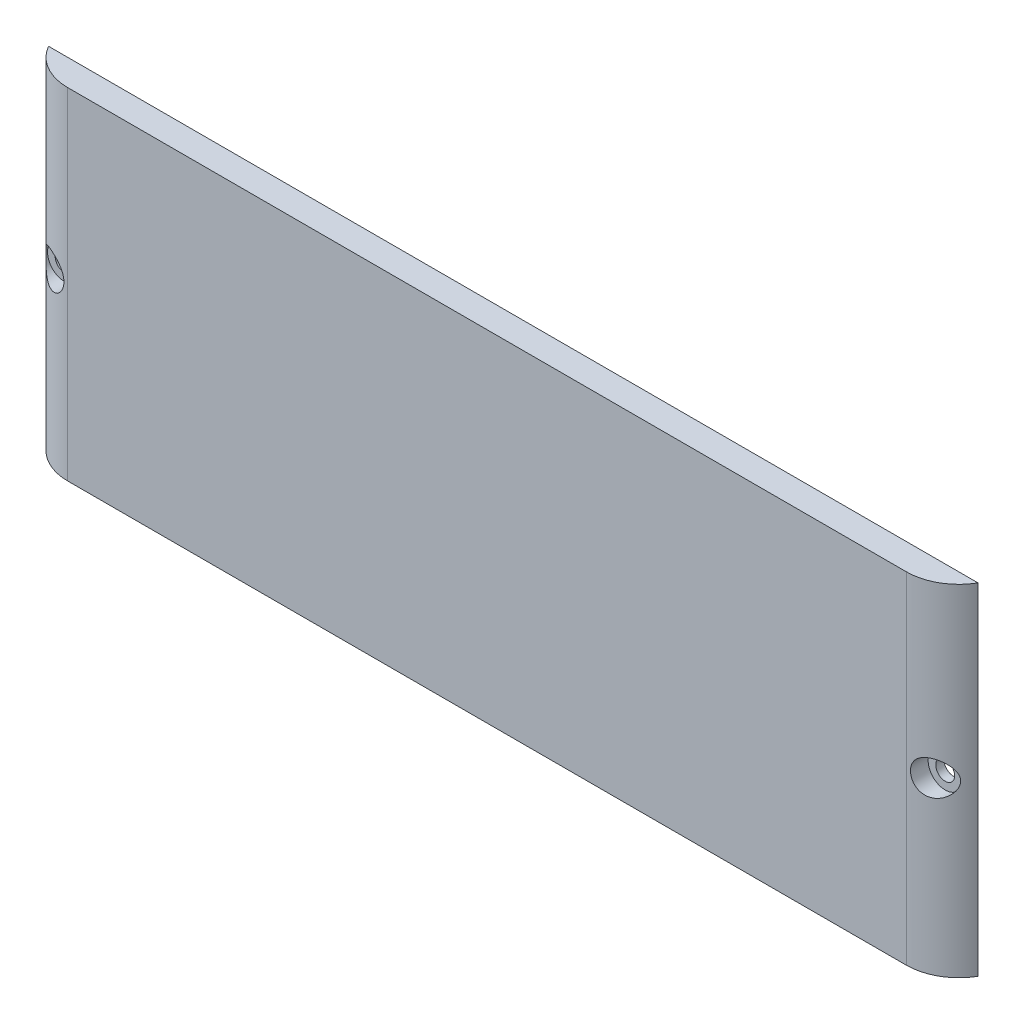
ISO-10303-21;
HEADER;
FILE_DESCRIPTION(('STEP AP214'),'2;1');
FILE_NAME('part.step','',(''),(''),'','','');
FILE_SCHEMA(('AUTOMOTIVE_DESIGN { 1 0 10303 214 1 1 1 1 }'));
ENDSEC;
DATA;
#1=APPLICATION_CONTEXT('core data for automotive mechanical design processes');
#2=APPLICATION_PROTOCOL_DEFINITION('international standard','automotive_design',2000,#1);
#3=PRODUCT_CONTEXT('',#1,'mechanical');
#4=PRODUCT('Part','Part','',(#3));
#5=PRODUCT_RELATED_PRODUCT_CATEGORY('part','',(#4));
#6=PRODUCT_DEFINITION_FORMATION('','',#4);
#7=PRODUCT_DEFINITION_CONTEXT('part definition',#1,'design');
#8=PRODUCT_DEFINITION('design','',#6,#7);
#9=PRODUCT_DEFINITION_SHAPE('','',#8);
#10=(LENGTH_UNIT() NAMED_UNIT(*) SI_UNIT(.MILLI.,.METRE.));
#11=(NAMED_UNIT(*) PLANE_ANGLE_UNIT() SI_UNIT($,.RADIAN.));
#12=(NAMED_UNIT(*) SI_UNIT($,.STERADIAN.) SOLID_ANGLE_UNIT());
#13=UNCERTAINTY_MEASURE_WITH_UNIT(LENGTH_MEASURE(1.E-05),#10,'distance_accuracy_value','');
#14=(GEOMETRIC_REPRESENTATION_CONTEXT(3) GLOBAL_UNCERTAINTY_ASSIGNED_CONTEXT((#13)) GLOBAL_UNIT_ASSIGNED_CONTEXT((#10,
#11,#12)) REPRESENTATION_CONTEXT('',''));
#15=CARTESIAN_POINT('',(0.,0.,0.));
#16=DIRECTION('',(0.,0.,1.));
#17=DIRECTION('',(1.,0.,0.));
#18=AXIS2_PLACEMENT_3D('',#15,#16,#17);
#19=CARTESIAN_POINT('',(0.,0.,5.));
#20=DIRECTION('',(0.,0.,-1.));
#21=DIRECTION('',(-1.,0.,0.));
#22=AXIS2_PLACEMENT_3D('',#19,#20,#21);
#23=PLANE('',#22);
#24=DIRECTION('',(0.,1.,0.));
#25=VECTOR('',#24,1.);
#26=CARTESIAN_POINT('',(79.9999999999999,-32.5,4.99999999999998));
#27=LINE('',#26,#25);
#28=CARTESIAN_POINT('',(79.9999999999999,-32.5,4.99999999999998));
#29=VERTEX_POINT('',#28);
#30=CARTESIAN_POINT('',(79.9999999999999,32.5,4.99999999999998));
#31=VERTEX_POINT('',#30);
#32=EDGE_CURVE('E84',#29,#31,#27,.T.);
#33=ORIENTED_EDGE('',*,*,#32,.T.);
#34=DIRECTION('',(-1.,0.,0.));
#35=VECTOR('',#34,1.);
#36=CARTESIAN_POINT('',(90.,32.5,5.));
#37=LINE('',#36,#35);
#38=CARTESIAN_POINT('',(-79.9999999999999,32.5,5.));
#39=VERTEX_POINT('',#38);
#40=EDGE_CURVE('E11',#31,#39,#37,.T.);
#41=ORIENTED_EDGE('',*,*,#40,.T.);
#42=DIRECTION('',(0.,1.,0.));
#43=VECTOR('',#42,1.);
#44=CARTESIAN_POINT('',(-79.9999999999999,-32.5,5.));
#45=LINE('',#44,#43);
#46=CARTESIAN_POINT('',(-79.9999999999999,-32.5,5.));
#47=VERTEX_POINT('',#46);
#48=EDGE_CURVE('E102',#47,#39,#45,.T.);
#49=ORIENTED_EDGE('',*,*,#48,.F.);
#50=DIRECTION('',(1.,0.,0.));
#51=VECTOR('',#50,1.);
#52=CARTESIAN_POINT('',(90.,-32.5,5.));
#53=LINE('',#52,#51);
#54=EDGE_CURVE('E52',#47,#29,#53,.T.);
#55=ORIENTED_EDGE('',*,*,#54,.T.);
#56=EDGE_LOOP('',(#33,#41,#49,#55));
#57=FACE_BOUND('',#56,.T.);
#58=ADVANCED_FACE('F38',(#57),#23,.F.);
#59=CARTESIAN_POINT('',(90.,-32.5,5.));
#60=DIRECTION('',(0.,1.,0.));
#61=DIRECTION('',(-1.,0.,0.));
#62=AXIS2_PLACEMENT_3D('',#59,#60,#61);
#63=PLANE('',#62);
#64=DIRECTION('',(1.,0.,0.));
#65=VECTOR('',#64,1.);
#66=CARTESIAN_POINT('',(90.,-32.5,0.));
#67=LINE('',#66,#65);
#68=CARTESIAN_POINT('',(-88.6602540378444,-32.5,0.));
#69=VERTEX_POINT('',#68);
#70=CARTESIAN_POINT('',(88.6602540378444,-32.5,0.));
#71=VERTEX_POINT('',#70);
#72=EDGE_CURVE('E99',#69,#71,#67,.T.);
#73=ORIENTED_EDGE('',*,*,#72,.T.);
#74=CARTESIAN_POINT('',(80.,-32.5,-5.00000000000002));
#75=DIRECTION('',(0.,-1.,0.));
#76=DIRECTION('',(-1.,0.,0.));
#77=AXIS2_PLACEMENT_3D('',#74,#75,#76);
#78=CIRCLE('',#77,10.);
#79=EDGE_CURVE('E60',#71,#29,#78,.T.);
#80=ORIENTED_EDGE('',*,*,#79,.T.);
#81=ORIENTED_EDGE('',*,*,#54,.F.);
#82=CARTESIAN_POINT('',(-80.,-32.5,-5.));
#83=DIRECTION('',(0.,-1.,0.));
#84=DIRECTION('',(1.,0.,0.));
#85=AXIS2_PLACEMENT_3D('',#82,#83,#84);
#86=CIRCLE('',#85,10.);
#87=EDGE_CURVE('E154',#47,#69,#86,.T.);
#88=ORIENTED_EDGE('',*,*,#87,.T.);
#89=EDGE_LOOP('',(#73,#80,#81,#88));
#90=FACE_BOUND('',#89,.T.);
#91=ADVANCED_FACE('F40',(#90),#63,.F.);
#92=CARTESIAN_POINT('',(90.,32.5,5.));
#93=DIRECTION('',(0.,-1.,0.));
#94=DIRECTION('',(1.,0.,0.));
#95=AXIS2_PLACEMENT_3D('',#92,#93,#94);
#96=PLANE('',#95);
#97=ORIENTED_EDGE('',*,*,#40,.F.);
#98=CARTESIAN_POINT('',(80.,32.5,-5.00000000000002));
#99=DIRECTION('',(0.,-1.,0.));
#100=DIRECTION('',(-1.,0.,0.));
#101=AXIS2_PLACEMENT_3D('',#98,#99,#100);
#102=CIRCLE('',#101,10.);
#103=CARTESIAN_POINT('',(88.6602540378444,32.5,0.));
#104=VERTEX_POINT('',#103);
#105=EDGE_CURVE('E88',#104,#31,#102,.T.);
#106=ORIENTED_EDGE('',*,*,#105,.F.);
#107=DIRECTION('',(-1.,0.,0.));
#108=VECTOR('',#107,1.);
#109=CARTESIAN_POINT('',(90.,32.5,0.));
#110=LINE('',#109,#108);
#111=CARTESIAN_POINT('',(-88.6602540378443,32.5,0.));
#112=VERTEX_POINT('',#111);
#113=EDGE_CURVE('E103',#104,#112,#110,.T.);
#114=ORIENTED_EDGE('',*,*,#113,.T.);
#115=CARTESIAN_POINT('',(-80.,32.5,-5.));
#116=DIRECTION('',(0.,-1.,0.));
#117=DIRECTION('',(1.,0.,0.));
#118=AXIS2_PLACEMENT_3D('',#115,#116,#117);
#119=CIRCLE('',#118,10.);
#120=EDGE_CURVE('E68',#39,#112,#119,.T.);
#121=ORIENTED_EDGE('',*,*,#120,.F.);
#122=EDGE_LOOP('',(#97,#106,#114,#121));
#123=FACE_BOUND('',#122,.T.);
#124=ADVANCED_FACE('F141',(#123),#96,.F.);
#125=CARTESIAN_POINT('',(0.,0.,0.));
#126=DIRECTION('',(0.,0.,-1.));
#127=DIRECTION('',(-1.,0.,0.));
#128=AXIS2_PLACEMENT_3D('',#125,#126,#127);
#129=PLANE('',#128);
#130=DIRECTION('',(0.,1.,0.));
#131=VECTOR('',#130,1.);
#132=CARTESIAN_POINT('',(88.6602540378444,-32.5,0.));
#133=LINE('',#132,#131);
#134=EDGE_CURVE('E161',#71,#104,#133,.T.);
#135=ORIENTED_EDGE('',*,*,#134,.F.);
#136=ORIENTED_EDGE('',*,*,#72,.F.);
#137=DIRECTION('',(0.,1.,0.));
#138=VECTOR('',#137,1.);
#139=CARTESIAN_POINT('',(-88.6602540378444,-32.5,0.));
#140=LINE('',#139,#138);
#141=EDGE_CURVE('E125',#112,#69,#140,.F.);
#142=ORIENTED_EDGE('',*,*,#141,.F.);
#143=ORIENTED_EDGE('',*,*,#113,.F.);
#144=EDGE_LOOP('',(#135,#136,#142,#143));
#145=FACE_BOUND('',#144,.T.);
#146=CARTESIAN_POINT('',(-84.,0.,0.));
#147=DIRECTION('',(0.,0.,-1.));
#148=DIRECTION('',(-1.,0.,0.));
#149=AXIS2_PLACEMENT_3D('',#146,#147,#148);
#150=CIRCLE('',#149,1.8);
#151=CARTESIAN_POINT('',(-85.8,0.,0.));
#152=VERTEX_POINT('',#151);
#153=EDGE_CURVE('E115',#152,#152,#150,.T.);
#154=ORIENTED_EDGE('',*,*,#153,.F.);
#155=EDGE_LOOP('',(#154));
#156=FACE_BOUND('',#155,.T.);
#157=CARTESIAN_POINT('',(84.,0.,0.));
#158=DIRECTION('',(0.,0.,-1.));
#159=DIRECTION('',(-1.,0.,0.));
#160=AXIS2_PLACEMENT_3D('',#157,#158,#159);
#161=CIRCLE('',#160,1.8);
#162=CARTESIAN_POINT('',(82.2,0.,0.));
#163=VERTEX_POINT('',#162);
#164=EDGE_CURVE('E111',#163,#163,#161,.T.);
#165=ORIENTED_EDGE('',*,*,#164,.F.);
#166=EDGE_LOOP('',(#165));
#167=FACE_BOUND('',#166,.T.);
#168=ADVANCED_FACE('F146',(#145,#156,#167),#129,.T.);
#169=CARTESIAN_POINT('',(84.,0.,5.));
#170=DIRECTION('',(0.,0.,1.));
#171=DIRECTION('',(1.,0.,0.));
#172=AXIS2_PLACEMENT_3D('',#169,#170,#171);
#173=CYLINDRICAL_SURFACE('',#172,1.8);
#174=ORIENTED_EDGE('',*,*,#164,.T.);
#175=EDGE_LOOP('',(#174));
#176=FACE_BOUND('',#175,.T.);
#177=CARTESIAN_POINT('',(84.,0.,1.6));
#178=DIRECTION('',(0.,0.,1.));
#179=DIRECTION('',(1.,0.,0.));
#180=AXIS2_PLACEMENT_3D('',#177,#178,#179);
#181=CIRCLE('',#180,1.8);
#182=CARTESIAN_POINT('',(85.8,0.,1.6));
#183=VERTEX_POINT('',#182);
#184=EDGE_CURVE('E108',#183,#183,#181,.T.);
#185=ORIENTED_EDGE('',*,*,#184,.T.);
#186=EDGE_LOOP('',(#185));
#187=FACE_BOUND('',#186,.T.);
#188=ADVANCED_FACE('F144',(#176,#187),#173,.F.);
#189=CARTESIAN_POINT('',(85.8,0.,1.6));
#190=DIRECTION('',(0.,0.,-1.));
#191=DIRECTION('',(-1.,0.,0.));
#192=AXIS2_PLACEMENT_3D('',#189,#190,#191);
#193=PLANE('',#192);
#194=ORIENTED_EDGE('',*,*,#184,.F.);
#195=EDGE_LOOP('',(#194));
#196=FACE_BOUND('',#195,.T.);
#197=CARTESIAN_POINT('',(84.,0.,1.6));
#198=DIRECTION('',(0.,0.,1.));
#199=DIRECTION('',(1.,0.,0.));
#200=AXIS2_PLACEMENT_3D('',#197,#198,#199);
#201=CIRCLE('',#200,3.24999999999999);
#202=CARTESIAN_POINT('',(87.25,0.,1.6));
#203=VERTEX_POINT('',#202);
#204=EDGE_CURVE('E117',#203,#203,#201,.T.);
#205=ORIENTED_EDGE('',*,*,#204,.T.);
#206=EDGE_LOOP('',(#205));
#207=FACE_BOUND('',#206,.T.);
#208=ADVANCED_FACE('F174',(#196,#207),#193,.F.);
#209=CARTESIAN_POINT('',(84.,0.,5.));
#210=DIRECTION('',(0.,0.,1.));
#211=DIRECTION('',(1.,0.,0.));
#212=AXIS2_PLACEMENT_3D('',#209,#210,#211);
#213=CYLINDRICAL_SURFACE('',#212,3.24999999999999);
#214=CARTESIAN_POINT('',(87.25,0.,1.88748865697794));
#215=CARTESIAN_POINT('',(87.2499994490645,0.0739982902647553,1.88748949602639));
#216=CARTESIAN_POINT('',(87.2474660038287,0.148023316325716,1.89015904051049));
#217=CARTESIAN_POINT('',(87.2373920388154,0.295390910229364,1.90073967900104));
#218=CARTESIAN_POINT('',(87.2298477045243,0.368732914962322,1.90865476613973));
#219=CARTESIAN_POINT('',(87.2099031709888,0.514221604282378,1.92946630024935));
#220=CARTESIAN_POINT('',(87.1974911282338,0.58636492270427,1.94237489576072));
#221=CARTESIAN_POINT('',(87.1680785909826,0.728748061257662,1.97273942809467));
#222=CARTESIAN_POINT('',(87.1510755898218,0.798986818374978,1.99019784894149));
#223=CARTESIAN_POINT('',(87.0940683799216,1.00463314056763,2.04819885998978));
#224=CARTESIAN_POINT('',(87.047815346268,1.13671157041791,2.09463713112362));
#225=CARTESIAN_POINT('',(86.9410674355679,1.38980442278871,2.19910830230638));
#226=CARTESIAN_POINT('',(86.880568562788,1.51081572790962,2.25714445468586));
#227=CARTESIAN_POINT('',(86.7144285804897,1.79831096101184,2.41180196373468));
#228=CARTESIAN_POINT('',(86.6012357564244,1.9578051976291,2.51334120236726));
#229=CARTESIAN_POINT('',(86.3520407947369,2.25112004017155,2.72518323318272));
#230=CARTESIAN_POINT('',(86.2159996427268,2.38489587847482,2.83550084228217));
#231=CARTESIAN_POINT('',(85.9212259758405,2.62842402308829,3.06065490389207));
#232=CARTESIAN_POINT('',(85.7621087747106,2.73766716011384,3.17553743690887));
#233=CARTESIAN_POINT('',(85.4255427093748,2.92703742489397,3.40265469542226));
#234=CARTESIAN_POINT('',(85.248096443733,3.00716867266808,3.51488979348946));
#235=CARTESIAN_POINT('',(84.9621326652843,3.10615932839382,3.68280111904894));
#236=CARTESIAN_POINT('',(84.8588977111595,3.13631960776782,3.74102078904331));
#237=CARTESIAN_POINT('',(84.6485222944809,3.18647130576145,3.85468791696575));
#238=CARTESIAN_POINT('',(84.5413836129166,3.20646730086999,3.91013661237215));
#239=CARTESIAN_POINT('',(84.3240020368341,3.23566803435699,4.01763339057597));
#240=CARTESIAN_POINT('',(84.2137599634525,3.24487560030383,4.06968236103795));
#241=CARTESIAN_POINT('',(83.9911354998814,3.25189420108598,4.16982669047982));
#242=CARTESIAN_POINT('',(83.8787535238983,3.24970741954844,4.2179228051955));
#243=CARTESIAN_POINT('',(83.6661122438884,3.23435177731438,4.30436638766453));
#244=CARTESIAN_POINT('',(83.5659549823843,3.22248301133684,4.34319791228157));
#245=CARTESIAN_POINT('',(83.3658654589353,3.18914645646286,4.41712898709472));
#246=CARTESIAN_POINT('',(83.265933161007,3.16768033137511,4.45222918285315));
#247=CARTESIAN_POINT('',(83.0674237235064,3.11501819168274,4.51850065489413));
#248=CARTESIAN_POINT('',(82.9688455862923,3.0838297909902,4.54967497895728));
#249=CARTESIAN_POINT('',(82.7741046597179,3.01171993066548,4.60805250822144));
#250=CARTESIAN_POINT('',(82.6779415659308,2.9707997046508,4.63525621603766));
#251=CARTESIAN_POINT('',(82.501641291839,2.88543090909036,4.68240629224696));
#252=CARTESIAN_POINT('',(82.4210620277849,2.84215768725872,4.70283661264364));
#253=CARTESIAN_POINT('',(82.2633260190346,2.74861304463658,4.74083867336138));
#254=CARTESIAN_POINT('',(82.1861703472566,2.69833945014464,4.75840952209203));
#255=CARTESIAN_POINT('',(82.0360809947966,2.59114210157604,4.79082559498984));
#256=CARTESIAN_POINT('',(81.9631448832096,2.53422223466253,4.80567239941455));
#257=CARTESIAN_POINT('',(81.8221182586382,2.41411013376238,4.83285562468033));
#258=CARTESIAN_POINT('',(81.7540295308738,2.35091560922044,4.84519112372309));
#259=CARTESIAN_POINT('',(81.564322911341,2.15897800510915,4.8776915151516));
#260=CARTESIAN_POINT('',(81.4498196254816,2.02252590171412,4.89488217356677));
#261=CARTESIAN_POINT('',(81.2444666212765,1.73239108378265,4.92280744087596));
#262=CARTESIAN_POINT('',(81.1536167570604,1.57870847551496,4.93354208958468));
#263=CARTESIAN_POINT('',(80.9976488921822,1.2571878262398,4.95042272350023));
#264=CARTESIAN_POINT('',(80.9327187542299,1.08925676891452,4.95653548511993));
#265=CARTESIAN_POINT('',(80.8314304451484,0.744909197974239,4.96550702164779));
#266=CARTESIAN_POINT('',(80.7950741227043,0.568492136110333,4.96836558601942));
#267=CARTESIAN_POINT('',(80.7517047069133,0.209929953572049,4.97173159547445));
#268=CARTESIAN_POINT('',(80.7450453378134,0.0277416823011363,4.9722107061747));
#269=CARTESIAN_POINT('',(80.7622297067573,-0.335187048795405,4.97091146616218));
#270=CARTESIAN_POINT('',(80.7860746052609,-0.515927453277281,4.9691330295666));
#271=CARTESIAN_POINT('',(80.8636942891681,-0.871359524814113,4.96270739034012));
#272=CARTESIAN_POINT('',(80.9175545529543,-1.04603239651563,4.95805199049019));
#273=CARTESIAN_POINT('',(81.0536769269325,-1.38377214933641,4.94456709572932));
#274=CARTESIAN_POINT('',(81.1359386255271,-1.54683919860748,4.93573766130836));
#275=CARTESIAN_POINT('',(81.3258993412196,-1.85591880391201,4.9121678795648));
#276=CARTESIAN_POINT('',(81.4334800265091,-2.0020061103563,4.89745481307335));
#277=CARTESIAN_POINT('',(81.6708009883032,-2.27373191036255,4.86016243838741));
#278=CARTESIAN_POINT('',(81.8005376842913,-2.39937370161996,4.83758440059756));
#279=CARTESIAN_POINT('',(82.0758671626396,-2.62516297928077,4.78315692684772));
#280=CARTESIAN_POINT('',(82.2212217148525,-2.72563234372702,4.75143703931312));
#281=CARTESIAN_POINT('',(82.5241770911656,-2.90087377207861,4.6774381268821));
#282=CARTESIAN_POINT('',(82.6817767627378,-2.9756482508391,4.63516009490578));
#283=CARTESIAN_POINT('',(83.0037622766521,-3.0983348298068,4.53968399510787));
#284=CARTESIAN_POINT('',(83.1681425247189,-3.1462686169824,4.48649479100882));
#285=CARTESIAN_POINT('',(83.4987235501278,-3.21555140226545,4.36961553834898));
#286=CARTESIAN_POINT('',(83.6649247447591,-3.23689417253997,4.30592303378338));
#287=CARTESIAN_POINT('',(84.0036662618076,-3.25465795775322,4.16548201541702));
#288=CARTESIAN_POINT('',(84.1760618404178,-3.24966531734899,4.08821292665844));
#289=CARTESIAN_POINT('',(84.513926158303,-3.21360913094273,3.92522951569884));
#290=CARTESIAN_POINT('',(84.6793927034015,-3.18253739119697,3.83951254674521));
#291=CARTESIAN_POINT('',(85.0197027795892,-3.09149405373475,3.65128560757514));
#292=CARTESIAN_POINT('',(85.1933056784492,-3.02851386105056,3.5479927229116));
#293=CARTESIAN_POINT('',(85.5255286807376,-2.87554743983906,3.33710692706942));
#294=CARTESIAN_POINT('',(85.6841303516089,-2.78552854044128,3.22950895115399));
#295=CARTESIAN_POINT('',(86.0039586728963,-2.56690913810534,2.99975964446332));
#296=CARTESIAN_POINT('',(86.1627538652501,-2.43477890652404,2.8775671758994));
#297=CARTESIAN_POINT('',(86.4549538248708,-2.13980039145733,2.63995365975544));
#298=CARTESIAN_POINT('',(86.5883831842904,-1.97698216817041,2.52452612947011));
#299=CARTESIAN_POINT('',(86.7889970944861,-1.6751424173754,2.34315562776024));
#300=CARTESIAN_POINT('',(86.8639894300642,-1.5439318298669,2.27283618553261));
#301=CARTESIAN_POINT('',(86.9967164881924,-1.26714027799061,2.14523689987004));
#302=CARTESIAN_POINT('',(87.0544767511753,-1.12158101078815,2.08793778876133));
#303=CARTESIAN_POINT('',(87.140431667704,-0.846667988082033,2.00123259157677));
#304=CARTESIAN_POINT('',(87.1721493023736,-0.719442576729664,1.96860284795026));
#305=CARTESIAN_POINT('',(87.2200782158581,-0.459297429881586,1.91893785654021));
#306=CARTESIAN_POINT('',(87.2363349769141,-0.326395605927594,1.90185687436178));
#307=CARTESIAN_POINT('',(87.2461888194016,-0.160624114583075,1.89149808403918));
#308=CARTESIAN_POINT('',(87.2476164149723,-0.128540569164138,1.88999682607956));
#309=CARTESIAN_POINT('',(87.2495221903598,-0.0643063710992572,1.88799186154628));
#310=CARTESIAN_POINT('',(87.2500002394072,-0.0321557098205085,1.88748829237223));
#311=CARTESIAN_POINT('',(87.25,0.,1.88748865697794));
#312=B_SPLINE_CURVE_WITH_KNOTS('',3,(#214,#215,#216,#217,#218,#219,#220,#221,#222,#223,#224,
#225,#226,#227,#228,#229,#230,#231,#232,#233,#234,#235,#236,#237,#238,#239,#240,#241,#242,#243,
#244,#245,#246,#247,#248,#249,#250,#251,#252,#253,#254,#255,#256,#257,#258,#259,#260,#261,#262,
#263,#264,#265,#266,#267,#268,#269,#270,#271,#272,#273,#274,#275,#276,#277,#278,#279,#280,#281,
#282,#283,#284,#285,#286,#287,#288,#289,#290,#291,#292,#293,#294,#295,#296,#297,#298,#299,#300,
#301,#302,#303,#304,#305,#306,#307,#308,#309,#310,#311),.UNSPECIFIED.,.T.,.F.,(4,2,2,2,2,2,2,2,
2,2,2,2,2,2,2,2,2,2,2,2,2,2,2,2,2,2,2,2,2,2,2,2,2,2,2,2,2,2,2,2,2,2,2,2,2,2,2,2,4),(0.,
0.221950964959526,0.444071082894586,0.666735022978144,0.889520784350385,1.32982636652641,
1.77025559489705,2.42779267942715,3.08646416622115,3.75775056870203,4.4289419312684,
4.79540005381448,5.1616930313961,5.52788998477757,5.89401676229383,6.21777646238711,
6.54148005689428,6.86493078004882,7.18834052404643,7.46913668158138,7.75002022500542,
8.03074030503446,8.31156324096572,8.84569110128984,9.37981566757353,9.91774411506878,
10.4557073629022,11.0000615350031,11.544436416337,12.09036956098,12.6362947942202,
13.1797175359838,13.723052541013,14.2590376940323,14.7949724603424,15.3304735703984,
15.8661000756174,16.4307614476731,16.9956002960752,17.6279051451361,18.2609771028008,
18.9778477849699,19.6940198771362,20.1924934965223,20.6902245927211,21.0939914986637,
21.4965669096869,21.5930016801432,21.6894497304709),.UNSPECIFIED.);
#313=CARTESIAN_POINT('',(87.25,0.,1.88748865697794));
#314=VERTEX_POINT('',#313);
#315=EDGE_CURVE('E42',#314,#314,#312,.T.);
#316=ORIENTED_EDGE('',*,*,#315,.T.);
#317=EDGE_LOOP('',(#316));
#318=FACE_BOUND('',#317,.T.);
#319=ORIENTED_EDGE('',*,*,#204,.F.);
#320=EDGE_LOOP('',(#319));
#321=FACE_BOUND('',#320,.T.);
#322=ADVANCED_FACE('F176',(#318,#321),#213,.F.);
#323=CARTESIAN_POINT('',(-84.,0.,5.));
#324=DIRECTION('',(0.,0.,1.));
#325=DIRECTION('',(1.,0.,0.));
#326=AXIS2_PLACEMENT_3D('',#323,#324,#325);
#327=CYLINDRICAL_SURFACE('',#326,1.8);
#328=ORIENTED_EDGE('',*,*,#153,.T.);
#329=EDGE_LOOP('',(#328));
#330=FACE_BOUND('',#329,.T.);
#331=CARTESIAN_POINT('',(-84.,0.,1.6));
#332=DIRECTION('',(0.,0.,1.));
#333=DIRECTION('',(1.,0.,0.));
#334=AXIS2_PLACEMENT_3D('',#331,#332,#333);
#335=CIRCLE('',#334,1.8);
#336=CARTESIAN_POINT('',(-82.2,0.,1.6));
#337=VERTEX_POINT('',#336);
#338=EDGE_CURVE('E118',#337,#337,#335,.T.);
#339=ORIENTED_EDGE('',*,*,#338,.T.);
#340=EDGE_LOOP('',(#339));
#341=FACE_BOUND('',#340,.T.);
#342=ADVANCED_FACE('F181',(#330,#341),#327,.F.);
#343=CARTESIAN_POINT('',(-82.2,0.,1.6));
#344=DIRECTION('',(0.,0.,-1.));
#345=DIRECTION('',(-1.,0.,0.));
#346=AXIS2_PLACEMENT_3D('',#343,#344,#345);
#347=PLANE('',#346);
#348=ORIENTED_EDGE('',*,*,#338,.F.);
#349=EDGE_LOOP('',(#348));
#350=FACE_BOUND('',#349,.T.);
#351=CARTESIAN_POINT('',(-84.,0.,1.6));
#352=DIRECTION('',(0.,0.,1.));
#353=DIRECTION('',(1.,0.,0.));
#354=AXIS2_PLACEMENT_3D('',#351,#352,#353);
#355=CIRCLE('',#354,3.24999999999999);
#356=CARTESIAN_POINT('',(-80.75,0.,1.6));
#357=VERTEX_POINT('',#356);
#358=EDGE_CURVE('E163',#357,#357,#355,.T.);
#359=ORIENTED_EDGE('',*,*,#358,.T.);
#360=EDGE_LOOP('',(#359));
#361=FACE_BOUND('',#360,.T.);
#362=ADVANCED_FACE('F187',(#350,#361),#347,.F.);
#363=CARTESIAN_POINT('',(-84.,0.,5.));
#364=DIRECTION('',(0.,0.,1.));
#365=DIRECTION('',(1.,0.,0.));
#366=AXIS2_PLACEMENT_3D('',#363,#364,#365);
#367=CYLINDRICAL_SURFACE('',#366,3.24999999999999);
#368=CARTESIAN_POINT('',(-80.75,0.,4.97183533758957));
#369=CARTESIAN_POINT('',(-80.7500000354527,0.181729237585233,4.97183501793272));
#370=CARTESIAN_POINT('',(-80.7652787769368,0.363454510103201,4.97072141235285));
#371=CARTESIAN_POINT('',(-80.8259541199082,0.721766305106831,4.96587754278699));
#372=CARTESIAN_POINT('',(-80.871349323803,0.8983530656547,4.96214740022425));
#373=CARTESIAN_POINT('',(-80.990952575155,1.24142776944402,4.9509596306358));
#374=CARTESIAN_POINT('',(-81.0651695973721,1.40791254836339,4.94350084234761));
#375=CARTESIAN_POINT('',(-81.240176454244,1.72592159032894,4.92318936084757));
#376=CARTESIAN_POINT('',(-81.3409650998759,1.87744652237913,4.91033690897531));
#377=CARTESIAN_POINT('',(-81.5651840510754,2.16021182562294,4.87739409260291));
#378=CARTESIAN_POINT('',(-81.6884643735695,2.29157653799414,4.85735087042634));
#379=CARTESIAN_POINT('',(-81.953963721757,2.53144814569366,4.8081701664452));
#380=CARTESIAN_POINT('',(-82.0961793826856,2.63995909325762,4.77903429914887));
#381=CARTESIAN_POINT('',(-82.3926027807961,2.83008247721733,4.71072813646079));
#382=CARTESIAN_POINT('',(-82.5466246915915,2.91203525642011,4.67169725773484));
#383=CARTESIAN_POINT('',(-82.8630566410859,3.04952906913857,4.58279177479097));
#384=CARTESIAN_POINT('',(-83.025466726165,3.1050699565995,4.53291711061038));
#385=CARTESIAN_POINT('',(-83.3558667309396,3.19016037425395,4.42172847487054));
#386=CARTESIAN_POINT('',(-83.5239033550995,3.21932312094348,4.36025976010466));
#387=CARTESIAN_POINT('',(-83.8585067216528,3.25127057018507,4.22737111334339));
#388=CARTESIAN_POINT('',(-84.0250729351745,3.25404613951242,4.15594774448578));
#389=CARTESIAN_POINT('',(-84.3658672766997,3.23419989969475,3.99873003883074));
#390=CARTESIAN_POINT('',(-84.5396544037018,3.20954505349592,3.91224504466844));
#391=CARTESIAN_POINT('',(-84.8774172242735,3.13410594800884,3.7319823963186));
#392=CARTESIAN_POINT('',(-85.041390268324,3.0833146678414,3.6382027883697));
#393=CARTESIAN_POINT('',(-85.3781660253733,2.94961720783711,3.43321927297514));
#394=CARTESIAN_POINT('',(-85.5492238977303,2.86332824950044,3.3213608538421));
#395=CARTESIAN_POINT('',(-85.8733238849309,2.66262568446372,3.09586796882594));
#396=CARTESIAN_POINT('',(-86.0263306544814,2.54815821131038,2.98223049631911));
#397=CARTESIAN_POINT('',(-86.2477893660206,2.34971798549841,2.80866540200932));
#398=CARTESIAN_POINT('',(-86.3235283189904,2.27489875310466,2.74737735396609));
#399=CARTESIAN_POINT('',(-86.4681428145103,2.11712671927884,2.62705432994253));
#400=CARTESIAN_POINT('',(-86.5370162207769,2.0341714020532,2.56802005875117));
#401=CARTESIAN_POINT('',(-86.6670325730643,1.86042437101517,2.4537340162035));
#402=CARTESIAN_POINT('',(-86.7281960536971,1.76965460544527,2.39847238506013));
#403=CARTESIAN_POINT('',(-86.8421491008316,1.58015954819506,2.29321684345622));
#404=CARTESIAN_POINT('',(-86.8949414269889,1.48143689453622,2.24322119882994));
#405=CARTESIAN_POINT('',(-87.0000312688411,1.25712856625281,2.14183650015997));
#406=CARTESIAN_POINT('',(-87.0504168446937,1.12995860330385,2.09191236879371));
#407=CARTESIAN_POINT('',(-87.1355700705222,0.865928708404125,2.00623556279521));
#408=CARTESIAN_POINT('',(-87.1703603838932,0.729083174479871,1.97046233269859));
#409=CARTESIAN_POINT('',(-87.2092397853733,0.518160559593223,1.93016595310789));
#410=CARTESIAN_POINT('',(-87.220002770459,0.446518594624986,1.91893791612131));
#411=CARTESIAN_POINT('',(-87.2367439171642,0.302094939063971,1.90142659473381));
#412=CARTESIAN_POINT('',(-87.2427244969909,0.22931384347521,1.89514081132595));
#413=CARTESIAN_POINT('',(-87.2497555167708,0.0832613816791262,1.8877479660797));
#414=CARTESIAN_POINT('',(-87.2508068327075,0.00999010490016916,1.88663998409023));
#415=CARTESIAN_POINT('',(-87.2479652706707,-0.136327537710553,1.8896297396568));
#416=CARTESIAN_POINT('',(-87.244072761163,-0.209373919897104,1.8937270892568));
#417=CARTESIAN_POINT('',(-87.2266727871406,-0.408998648021694,1.91198193428551));
#418=CARTESIAN_POINT('',(-87.2081493169179,-0.534721282190015,1.93137389859645));
#419=CARTESIAN_POINT('',(-87.1574311850562,-0.780339540106101,1.98372929189524));
#420=CARTESIAN_POINT('',(-87.1252275649943,-0.90023128806953,2.01670161352558));
#421=CARTESIAN_POINT('',(-87.0343050000041,-1.17637198648124,2.10802962579182));
#422=CARTESIAN_POINT('',(-86.9701640933473,-1.32921950059461,2.17126912689398));
#423=CARTESIAN_POINT('',(-86.8229468595441,-1.61863838168974,2.31148235196894));
#424=CARTESIAN_POINT('',(-86.739826510988,-1.75517076743919,2.38848791370997));
#425=CARTESIAN_POINT('',(-86.5282414198817,-2.05271465182897,2.57679958064359));
#426=CARTESIAN_POINT('',(-86.3937816672011,-2.20754924918429,2.69118950113009));
#427=CARTESIAN_POINT('',(-86.1744709736608,-2.41752407786656,2.86668846404592));
#428=CARTESIAN_POINT('',(-86.0983705478657,-2.4838418111104,2.92588368053644));
#429=CARTESIAN_POINT('',(-85.9406089386421,-2.60896141578952,3.04480737915859));
#430=CARTESIAN_POINT('',(-85.8589476607296,-2.66776315947236,3.10453587033606));
#431=CARTESIAN_POINT('',(-85.6041329319489,-2.83383834971735,3.28475065763169));
#432=CARTESIAN_POINT('',(-85.4227324837908,-2.92926653220844,3.40497516472666));
#433=CARTESIAN_POINT('',(-85.1372331931055,-3.04627630390101,3.58029329961141));
#434=CARTESIAN_POINT('',(-85.039788538768,-3.08093348765871,3.63792011573364));
#435=CARTESIAN_POINT('',(-84.8408639863974,-3.14105543003416,3.75094717683172));
#436=CARTESIAN_POINT('',(-84.7393860699038,-3.16652464220748,3.80634848894076));
#437=CARTESIAN_POINT('',(-84.5324605401307,-3.20783073975766,3.91462385800207));
#438=CARTESIAN_POINT('',(-84.4269947006403,-3.22361573057158,3.96748292407487));
#439=CARTESIAN_POINT('',(-84.2134420706281,-3.24475661105321,4.06977996178036));
#440=CARTESIAN_POINT('',(-84.1053567091241,-3.25011806290524,4.11921974441123));
#441=CARTESIAN_POINT('',(-83.8875517252943,-3.24987806899059,4.21417641571506));
#442=CARTESIAN_POINT('',(-83.7778331289122,-3.24428323924971,4.25969565450724));
#443=CARTESIAN_POINT('',(-83.55786821593,-3.22168206377901,4.3464185497794));
#444=CARTESIAN_POINT('',(-83.4476220107969,-3.20467803119318,4.38762307908229));
#445=CARTESIAN_POINT('',(-83.2433048737299,-3.16215575907519,4.45996985541824));
#446=CARTESIAN_POINT('',(-83.1491277668629,-3.13816056060074,4.49171345951856));
#447=CARTESIAN_POINT('',(-82.962299087357,-3.08142877265843,4.55167021585053));
#448=CARTESIAN_POINT('',(-82.8696472929035,-3.04869346633486,4.57988388542331));
#449=CARTESIAN_POINT('',(-82.6868859608938,-2.97455069921122,4.63274056508749));
#450=CARTESIAN_POINT('',(-82.596775129229,-2.93314774677486,4.65738542022185));
#451=CARTESIAN_POINT('',(-82.4200365519682,-2.84184900257243,4.70318276761988));
#452=CARTESIAN_POINT('',(-82.3334085453224,-2.79195384879914,4.72433552199925));
#453=CARTESIAN_POINT('',(-82.1736474693904,-2.68978462825379,4.76121119427836));
#454=CARTESIAN_POINT('',(-82.1000624893841,-2.63833698482982,4.77727297032072));
#455=CARTESIAN_POINT('',(-81.9570695280562,-2.52923421189581,4.80689614134835));
#456=CARTESIAN_POINT('',(-81.8876629664158,-2.47157699093785,4.82045668969727));
#457=CARTESIAN_POINT('',(-81.7537007433572,-2.35048581413559,4.84526146088375));
#458=CARTESIAN_POINT('',(-81.6891425681946,-2.287054890052,4.85650688938263));
#459=CARTESIAN_POINT('',(-81.5653829504838,-2.15484469892209,4.87691814659773));
#460=CARTESIAN_POINT('',(-81.5061835088736,-2.08606345175686,4.88608320041717));
#461=CARTESIAN_POINT('',(-81.3399922869741,-1.87569216943688,4.9104375086402));
#462=CARTESIAN_POINT('',(-81.2411989137154,-1.72716432513606,4.92304772994871));
#463=CARTESIAN_POINT('',(-81.0691611051987,-1.41576375216728,4.94306000711247));
#464=CARTESIAN_POINT('',(-80.99591953533,-1.25288941724165,4.95046147895111));
#465=CARTESIAN_POINT('',(-80.8749513491056,-0.91132252751286,4.96184246324656));
#466=CARTESIAN_POINT('',(-80.8282087360951,-0.732275674875458,4.96569297843148));
#467=CARTESIAN_POINT('',(-80.7657322086802,-0.368818046094841,4.97068965059793));
#468=CARTESIAN_POINT('',(-80.749999964025,-0.184406981658876,4.97183566195649));
#469=CARTESIAN_POINT('',(-80.75,0.,4.97183533758957));
#470=B_SPLINE_CURVE_WITH_KNOTS('',3,(#368,#369,#370,#371,#372,#373,#374,#375,#376,#377,#378,
#379,#380,#381,#382,#383,#384,#385,#386,#387,#388,#389,#390,#391,#392,#393,#394,#395,#396,#397,
#398,#399,#400,#401,#402,#403,#404,#405,#406,#407,#408,#409,#410,#411,#412,#413,#414,#415,#416,
#417,#418,#419,#420,#421,#422,#423,#424,#425,#426,#427,#428,#429,#430,#431,#432,#433,#434,#435,
#436,#437,#438,#439,#440,#441,#442,#443,#444,#445,#446,#447,#448,#449,#450,#451,#452,#453,#454,
#455,#456,#457,#458,#459,#460,#461,#462,#463,#464,#465,#466,#467,#468,#469),.UNSPECIFIED.,.T.,
.F.,(4,2,2,2,2,2,2,2,2,2,2,2,2,2,2,2,2,2,2,2,2,2,2,2,2,2,2,2,2,2,2,2,2,2,2,2,2,2,2,2,2,2,2,2,2,
2,2,2,2,2,4),(0.,0.544540166356607,1.08905506440663,1.63373965383415,2.17839987393591,
2.71955269345072,3.26060947940771,3.79442992822782,4.3282533289795,4.86978295898581,
5.4115000183535,5.99620817410918,6.58107347869313,7.24403892849186,7.90828169027398,
8.2764136500024,8.64465980243727,9.01190345859664,9.37902579546547,9.814314295724,
10.2489681575338,10.4686183645188,10.6881574357598,10.9076574910595,11.1271411878668,
11.5109083792932,11.8949272683591,12.424203200527,12.9547194486107,13.6552477741497,
14.0060079947853,14.3567741766467,15.0658563774104,15.4207050578186,15.7753815055994,
16.1319423159152,16.4883128068118,16.8444681672996,17.2005513413419,17.5068426172357,
17.8130889508923,18.1191763885031,18.4252408408547,18.6985416303533,18.9719347598864,
19.2451851503638,19.5185371545816,20.052305504635,20.5861336924551,21.1386677992561,
21.6912316563665),.UNSPECIFIED.);
#471=CARTESIAN_POINT('',(-80.75,0.,4.97183533758957));
#472=VERTEX_POINT('',#471);
#473=EDGE_CURVE('E92',#472,#472,#470,.T.);
#474=ORIENTED_EDGE('',*,*,#473,.T.);
#475=EDGE_LOOP('',(#474));
#476=FACE_BOUND('',#475,.T.);
#477=ORIENTED_EDGE('',*,*,#358,.F.);
#478=EDGE_LOOP('',(#477));
#479=FACE_BOUND('',#478,.T.);
#480=ADVANCED_FACE('F126',(#476,#479),#367,.F.);
#481=CARTESIAN_POINT('',(-80.,-32.5,-5.));
#482=DIRECTION('',(0.,1.,0.));
#483=DIRECTION('',(-1.,0.,0.));
#484=AXIS2_PLACEMENT_3D('',#481,#482,#483);
#485=CYLINDRICAL_SURFACE('',#484,10.);
#486=ORIENTED_EDGE('',*,*,#141,.T.);
#487=ORIENTED_EDGE('',*,*,#87,.F.);
#488=ORIENTED_EDGE('',*,*,#48,.T.);
#489=ORIENTED_EDGE('',*,*,#120,.T.);
#490=EDGE_LOOP('',(#486,#487,#488,#489));
#491=FACE_BOUND('',#490,.T.);
#492=ORIENTED_EDGE('',*,*,#473,.F.);
#493=EDGE_LOOP('',(#492));
#494=FACE_BOUND('',#493,.T.);
#495=ADVANCED_FACE('F129',(#491,#494),#485,.T.);
#496=CARTESIAN_POINT('',(80.,-32.5,-5.00000000000002));
#497=DIRECTION('',(0.,1.,0.));
#498=DIRECTION('',(-1.,0.,0.));
#499=AXIS2_PLACEMENT_3D('',#496,#497,#498);
#500=CYLINDRICAL_SURFACE('',#499,10.);
#501=ORIENTED_EDGE('',*,*,#134,.T.);
#502=ORIENTED_EDGE('',*,*,#105,.T.);
#503=ORIENTED_EDGE('',*,*,#32,.F.);
#504=ORIENTED_EDGE('',*,*,#79,.F.);
#505=EDGE_LOOP('',(#501,#502,#503,#504));
#506=FACE_BOUND('',#505,.T.);
#507=ORIENTED_EDGE('',*,*,#315,.F.);
#508=EDGE_LOOP('',(#507));
#509=FACE_BOUND('',#508,.T.);
#510=ADVANCED_FACE('F85',(#506,#509),#500,.T.);
#511=CLOSED_SHELL('',(#58,#91,#124,#168,#188,#208,#322,#342,#362,#480,#495,#510));
#512=MANIFOLD_SOLID_BREP('B2',#511);
#513=ADVANCED_BREP_SHAPE_REPRESENTATION('',(#18,#512),#14);
#514=SHAPE_DEFINITION_REPRESENTATION(#9,#513);
ENDSEC;
END-ISO-10303-21;
